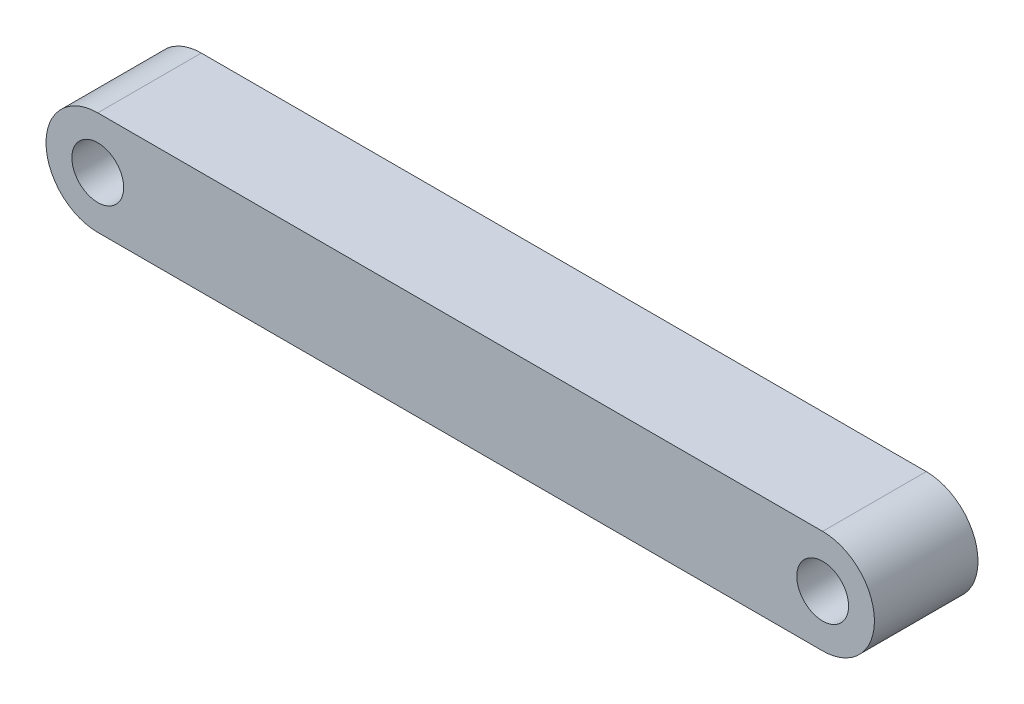
ISO-10303-21;
HEADER;
FILE_DESCRIPTION(('STEP AP214'),'2;1');
FILE_NAME('part.step','',(''),(''),'','','');
FILE_SCHEMA(('AUTOMOTIVE_DESIGN { 1 0 10303 214 1 1 1 1 }'));
ENDSEC;
DATA;
#1=APPLICATION_CONTEXT('core data for automotive mechanical design processes');
#2=APPLICATION_PROTOCOL_DEFINITION('international standard','automotive_design',2000,#1);
#3=PRODUCT_CONTEXT('',#1,'mechanical');
#4=PRODUCT('Part','Part','',(#3));
#5=PRODUCT_RELATED_PRODUCT_CATEGORY('part','',(#4));
#6=PRODUCT_DEFINITION_FORMATION('','',#4);
#7=PRODUCT_DEFINITION_CONTEXT('part definition',#1,'design');
#8=PRODUCT_DEFINITION('design','',#6,#7);
#9=PRODUCT_DEFINITION_SHAPE('','',#8);
#10=(LENGTH_UNIT() NAMED_UNIT(*) SI_UNIT(.MILLI.,.METRE.));
#11=(NAMED_UNIT(*) PLANE_ANGLE_UNIT() SI_UNIT($,.RADIAN.));
#12=(NAMED_UNIT(*) SI_UNIT($,.STERADIAN.) SOLID_ANGLE_UNIT());
#13=UNCERTAINTY_MEASURE_WITH_UNIT(LENGTH_MEASURE(1.E-05),#10,'distance_accuracy_value','');
#14=(GEOMETRIC_REPRESENTATION_CONTEXT(3) GLOBAL_UNCERTAINTY_ASSIGNED_CONTEXT((#13)) GLOBAL_UNIT_ASSIGNED_CONTEXT((#10,
#11,#12)) REPRESENTATION_CONTEXT('',''));
#15=CARTESIAN_POINT('',(0.,0.,0.));
#16=DIRECTION('',(0.,0.,1.));
#17=DIRECTION('',(1.,0.,0.));
#18=AXIS2_PLACEMENT_3D('',#15,#16,#17);
#19=CARTESIAN_POINT('',(0.,0.,10.));
#20=DIRECTION('',(0.,0.,1.));
#21=DIRECTION('',(1.,0.,0.));
#22=AXIS2_PLACEMENT_3D('',#19,#20,#21);
#23=PLANE('',#22);
#24=CARTESIAN_POINT('',(0.,0.,10.));
#25=DIRECTION('',(0.,0.,1.));
#26=DIRECTION('',(1.,0.,0.));
#27=AXIS2_PLACEMENT_3D('',#24,#25,#26);
#28=CIRCLE('',#27,2.5);
#29=CARTESIAN_POINT('',(2.5,0.,10.));
#30=VERTEX_POINT('',#29);
#31=EDGE_CURVE('E99',#30,#30,#28,.T.);
#32=ORIENTED_EDGE('',*,*,#31,.F.);
#33=EDGE_LOOP('',(#32));
#34=FACE_BOUND('',#33,.T.);
#35=CARTESIAN_POINT('',(0.,0.,10.));
#36=DIRECTION('',(0.,0.,1.));
#37=DIRECTION('',(1.,0.,0.));
#38=AXIS2_PLACEMENT_3D('',#35,#36,#37);
#39=CIRCLE('',#38,5.);
#40=CARTESIAN_POINT('',(0.,-5.,10.));
#41=VERTEX_POINT('',#40);
#42=CARTESIAN_POINT('',(0.,5.,10.));
#43=VERTEX_POINT('',#42);
#44=EDGE_CURVE('E84',#41,#43,#39,.T.);
#45=ORIENTED_EDGE('',*,*,#44,.T.);
#46=DIRECTION('',(-1.,0.,0.));
#47=VECTOR('',#46,1.);
#48=CARTESIAN_POINT('',(0.,5.,10.));
#49=LINE('',#48,#47);
#50=CARTESIAN_POINT('',(-70.,4.99999999999999,10.));
#51=VERTEX_POINT('',#50);
#52=EDGE_CURVE('E79',#43,#51,#49,.T.);
#53=ORIENTED_EDGE('',*,*,#52,.T.);
#54=CARTESIAN_POINT('',(-70.,0.,10.));
#55=DIRECTION('',(0.,0.,1.));
#56=DIRECTION('',(-1.,0.,0.));
#57=AXIS2_PLACEMENT_3D('',#54,#55,#56);
#58=CIRCLE('',#57,5.);
#59=CARTESIAN_POINT('',(-70.,-5.,10.));
#60=VERTEX_POINT('',#59);
#61=EDGE_CURVE('E82',#51,#60,#58,.T.);
#62=ORIENTED_EDGE('',*,*,#61,.T.);
#63=DIRECTION('',(1.,0.,0.));
#64=VECTOR('',#63,1.);
#65=CARTESIAN_POINT('',(0.,-5.,10.));
#66=LINE('',#65,#64);
#67=EDGE_CURVE('E49',#60,#41,#66,.T.);
#68=ORIENTED_EDGE('',*,*,#67,.T.);
#69=EDGE_LOOP('',(#45,#53,#62,#68));
#70=FACE_BOUND('',#69,.T.);
#71=CARTESIAN_POINT('',(-70.,0.,10.));
#72=DIRECTION('',(0.,0.,1.));
#73=DIRECTION('',(-1.,0.,0.));
#74=AXIS2_PLACEMENT_3D('',#71,#72,#73);
#75=CIRCLE('',#74,2.50000000000001);
#76=CARTESIAN_POINT('',(-72.5,0.,10.));
#77=VERTEX_POINT('',#76);
#78=EDGE_CURVE('E114',#77,#77,#75,.T.);
#79=ORIENTED_EDGE('',*,*,#78,.F.);
#80=EDGE_LOOP('',(#79));
#81=FACE_BOUND('',#80,.T.);
#82=ADVANCED_FACE('F32',(#34,#70,#81),#23,.T.);
#83=CARTESIAN_POINT('',(0.,0.,0.));
#84=DIRECTION('',(0.,0.,1.));
#85=DIRECTION('',(1.,0.,0.));
#86=AXIS2_PLACEMENT_3D('',#83,#84,#85);
#87=PLANE('',#86);
#88=CARTESIAN_POINT('',(0.,0.,0.));
#89=DIRECTION('',(0.,0.,1.));
#90=DIRECTION('',(1.,0.,0.));
#91=AXIS2_PLACEMENT_3D('',#88,#89,#90);
#92=CIRCLE('',#91,5.);
#93=CARTESIAN_POINT('',(0.,-5.,0.));
#94=VERTEX_POINT('',#93);
#95=CARTESIAN_POINT('',(0.,5.,0.));
#96=VERTEX_POINT('',#95);
#97=EDGE_CURVE('E96',#94,#96,#92,.T.);
#98=ORIENTED_EDGE('',*,*,#97,.F.);
#99=DIRECTION('',(1.,0.,0.));
#100=VECTOR('',#99,1.);
#101=CARTESIAN_POINT('',(0.,-5.,0.));
#102=LINE('',#101,#100);
#103=CARTESIAN_POINT('',(-70.,-5.,0.));
#104=VERTEX_POINT('',#103);
#105=EDGE_CURVE('E72',#104,#94,#102,.T.);
#106=ORIENTED_EDGE('',*,*,#105,.F.);
#107=CARTESIAN_POINT('',(-70.,0.,0.));
#108=DIRECTION('',(0.,0.,1.));
#109=DIRECTION('',(-1.,0.,0.));
#110=AXIS2_PLACEMENT_3D('',#107,#108,#109);
#111=CIRCLE('',#110,5.);
#112=CARTESIAN_POINT('',(-70.,4.99999999999999,0.));
#113=VERTEX_POINT('',#112);
#114=EDGE_CURVE('E66',#113,#104,#111,.T.);
#115=ORIENTED_EDGE('',*,*,#114,.F.);
#116=DIRECTION('',(-1.,0.,0.));
#117=VECTOR('',#116,1.);
#118=CARTESIAN_POINT('',(0.,5.,0.));
#119=LINE('',#118,#117);
#120=EDGE_CURVE('E88',#96,#113,#119,.T.);
#121=ORIENTED_EDGE('',*,*,#120,.F.);
#122=EDGE_LOOP('',(#98,#106,#115,#121));
#123=FACE_BOUND('',#122,.T.);
#124=CARTESIAN_POINT('',(0.,0.,0.));
#125=DIRECTION('',(0.,0.,1.));
#126=DIRECTION('',(1.,0.,0.));
#127=AXIS2_PLACEMENT_3D('',#124,#125,#126);
#128=CIRCLE('',#127,2.5);
#129=CARTESIAN_POINT('',(2.5,0.,0.));
#130=VERTEX_POINT('',#129);
#131=EDGE_CURVE('E111',#130,#130,#128,.T.);
#132=ORIENTED_EDGE('',*,*,#131,.T.);
#133=EDGE_LOOP('',(#132));
#134=FACE_BOUND('',#133,.T.);
#135=CARTESIAN_POINT('',(-70.,0.,0.));
#136=DIRECTION('',(0.,0.,1.));
#137=DIRECTION('',(-1.,0.,0.));
#138=AXIS2_PLACEMENT_3D('',#135,#136,#137);
#139=CIRCLE('',#138,2.50000000000001);
#140=CARTESIAN_POINT('',(-72.5,0.,0.));
#141=VERTEX_POINT('',#140);
#142=EDGE_CURVE('E117',#141,#141,#139,.T.);
#143=ORIENTED_EDGE('',*,*,#142,.T.);
#144=EDGE_LOOP('',(#143));
#145=FACE_BOUND('',#144,.T.);
#146=ADVANCED_FACE('F107',(#123,#134,#145),#87,.F.);
#147=CARTESIAN_POINT('',(0.,0.,10.));
#148=DIRECTION('',(0.,0.,-1.));
#149=DIRECTION('',(-1.,0.,0.));
#150=AXIS2_PLACEMENT_3D('',#147,#148,#149);
#151=CYLINDRICAL_SURFACE('',#150,5.);
#152=ORIENTED_EDGE('',*,*,#97,.T.);
#153=DIRECTION('',(0.,0.,-1.));
#154=VECTOR('',#153,1.);
#155=CARTESIAN_POINT('',(0.,5.,10.));
#156=LINE('',#155,#154);
#157=EDGE_CURVE('E11',#43,#96,#156,.T.);
#158=ORIENTED_EDGE('',*,*,#157,.F.);
#159=ORIENTED_EDGE('',*,*,#44,.F.);
#160=DIRECTION('',(0.,0.,-1.));
#161=VECTOR('',#160,1.);
#162=CARTESIAN_POINT('',(0.,-5.,10.));
#163=LINE('',#162,#161);
#164=EDGE_CURVE('E92',#41,#94,#163,.T.);
#165=ORIENTED_EDGE('',*,*,#164,.T.);
#166=EDGE_LOOP('',(#152,#158,#159,#165));
#167=FACE_BOUND('',#166,.T.);
#168=ADVANCED_FACE('F34',(#167),#151,.T.);
#169=CARTESIAN_POINT('',(0.,5.,10.));
#170=DIRECTION('',(0.,-1.,0.));
#171=DIRECTION('',(1.,0.,0.));
#172=AXIS2_PLACEMENT_3D('',#169,#170,#171);
#173=PLANE('',#172);
#174=ORIENTED_EDGE('',*,*,#120,.T.);
#175=DIRECTION('',(0.,0.,-1.));
#176=VECTOR('',#175,1.);
#177=CARTESIAN_POINT('',(-70.,4.99999999999999,10.));
#178=LINE('',#177,#176);
#179=EDGE_CURVE('E41',#51,#113,#178,.T.);
#180=ORIENTED_EDGE('',*,*,#179,.F.);
#181=ORIENTED_EDGE('',*,*,#52,.F.);
#182=ORIENTED_EDGE('',*,*,#157,.T.);
#183=EDGE_LOOP('',(#174,#180,#181,#182));
#184=FACE_BOUND('',#183,.T.);
#185=ADVANCED_FACE('F87',(#184),#173,.F.);
#186=CARTESIAN_POINT('',(-70.,0.,10.));
#187=DIRECTION('',(0.,0.,-1.));
#188=DIRECTION('',(-1.,0.,0.));
#189=AXIS2_PLACEMENT_3D('',#186,#187,#188);
#190=CYLINDRICAL_SURFACE('',#189,5.);
#191=ORIENTED_EDGE('',*,*,#114,.T.);
#192=DIRECTION('',(0.,0.,-1.));
#193=VECTOR('',#192,1.);
#194=CARTESIAN_POINT('',(-70.,-5.,10.));
#195=LINE('',#194,#193);
#196=EDGE_CURVE('E89',#60,#104,#195,.T.);
#197=ORIENTED_EDGE('',*,*,#196,.F.);
#198=ORIENTED_EDGE('',*,*,#61,.F.);
#199=ORIENTED_EDGE('',*,*,#179,.T.);
#200=EDGE_LOOP('',(#191,#197,#198,#199));
#201=FACE_BOUND('',#200,.T.);
#202=ADVANCED_FACE('F90',(#201),#190,.T.);
#203=CARTESIAN_POINT('',(0.,-5.,10.));
#204=DIRECTION('',(0.,1.,0.));
#205=DIRECTION('',(-1.,0.,0.));
#206=AXIS2_PLACEMENT_3D('',#203,#204,#205);
#207=PLANE('',#206);
#208=ORIENTED_EDGE('',*,*,#105,.T.);
#209=ORIENTED_EDGE('',*,*,#164,.F.);
#210=ORIENTED_EDGE('',*,*,#67,.F.);
#211=ORIENTED_EDGE('',*,*,#196,.T.);
#212=EDGE_LOOP('',(#208,#209,#210,#211));
#213=FACE_BOUND('',#212,.T.);
#214=ADVANCED_FACE('F104',(#213),#207,.F.);
#215=CARTESIAN_POINT('',(0.,0.,10.));
#216=DIRECTION('',(0.,0.,-1.));
#217=DIRECTION('',(-1.,0.,0.));
#218=AXIS2_PLACEMENT_3D('',#215,#216,#217);
#219=CYLINDRICAL_SURFACE('',#218,2.5);
#220=ORIENTED_EDGE('',*,*,#31,.T.);
#221=EDGE_LOOP('',(#220));
#222=FACE_BOUND('',#221,.T.);
#223=ORIENTED_EDGE('',*,*,#131,.F.);
#224=EDGE_LOOP('',(#223));
#225=FACE_BOUND('',#224,.T.);
#226=ADVANCED_FACE('F134',(#222,#225),#219,.F.);
#227=CARTESIAN_POINT('',(-70.,0.,10.));
#228=DIRECTION('',(0.,0.,-1.));
#229=DIRECTION('',(-1.,0.,0.));
#230=AXIS2_PLACEMENT_3D('',#227,#228,#229);
#231=CYLINDRICAL_SURFACE('',#230,2.50000000000001);
#232=ORIENTED_EDGE('',*,*,#78,.T.);
#233=EDGE_LOOP('',(#232));
#234=FACE_BOUND('',#233,.T.);
#235=ORIENTED_EDGE('',*,*,#142,.F.);
#236=EDGE_LOOP('',(#235));
#237=FACE_BOUND('',#236,.T.);
#238=ADVANCED_FACE('F123',(#234,#237),#231,.F.);
#239=CLOSED_SHELL('',(#82,#146,#168,#185,#202,#214,#226,#238));
#240=MANIFOLD_SOLID_BREP('B2',#239);
#241=ADVANCED_BREP_SHAPE_REPRESENTATION('',(#18,#240),#14);
#242=SHAPE_DEFINITION_REPRESENTATION(#9,#241);
ENDSEC;
END-ISO-10303-21;
